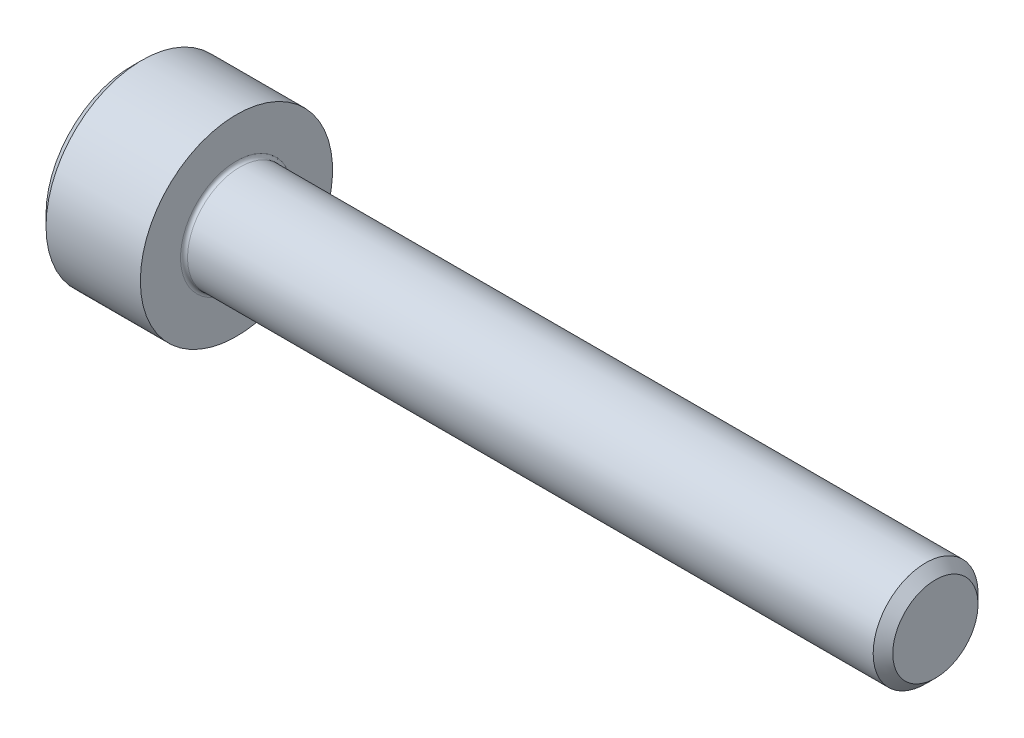
ISO-10303-21;
HEADER;
FILE_DESCRIPTION(('STEP AP214'),'2;1');
FILE_NAME('part.step','',(''),(''),'','','');
FILE_SCHEMA(('AUTOMOTIVE_DESIGN { 1 0 10303 214 1 1 1 1 }'));
ENDSEC;
DATA;
#1=APPLICATION_CONTEXT('core data for automotive mechanical design processes');
#2=APPLICATION_PROTOCOL_DEFINITION('international standard','automotive_design',2000,#1);
#3=PRODUCT_CONTEXT('',#1,'mechanical');
#4=PRODUCT('Part','Part','',(#3));
#5=PRODUCT_RELATED_PRODUCT_CATEGORY('part','',(#4));
#6=PRODUCT_DEFINITION_FORMATION('','',#4);
#7=PRODUCT_DEFINITION_CONTEXT('part definition',#1,'design');
#8=PRODUCT_DEFINITION('design','',#6,#7);
#9=PRODUCT_DEFINITION_SHAPE('','',#8);
#10=(LENGTH_UNIT() NAMED_UNIT(*) SI_UNIT(.MILLI.,.METRE.));
#11=(NAMED_UNIT(*) PLANE_ANGLE_UNIT() SI_UNIT($,.RADIAN.));
#12=(NAMED_UNIT(*) SI_UNIT($,.STERADIAN.) SOLID_ANGLE_UNIT());
#13=UNCERTAINTY_MEASURE_WITH_UNIT(LENGTH_MEASURE(1.E-05),#10,'distance_accuracy_value','');
#14=(GEOMETRIC_REPRESENTATION_CONTEXT(3) GLOBAL_UNCERTAINTY_ASSIGNED_CONTEXT((#13)) GLOBAL_UNIT_ASSIGNED_CONTEXT((#10,
#11,#12)) REPRESENTATION_CONTEXT('',''));
#15=CARTESIAN_POINT('',(0.,0.,0.));
#16=DIRECTION('',(0.,0.,1.));
#17=DIRECTION('',(1.,0.,0.));
#18=AXIS2_PLACEMENT_3D('',#15,#16,#17);
#19=CARTESIAN_POINT('',(0.,0.,0.));
#20=DIRECTION('',(-1.,0.,0.));
#21=DIRECTION('',(0.,0.,1.));
#22=AXIS2_PLACEMENT_3D('',#19,#20,#21);
#23=PLANE('',#22);
#24=DIRECTION('',(0.,-0.499999999999999,0.86602540378444));
#25=VECTOR('',#24,1.);
#26=CARTESIAN_POINT('',(0.,1.47801668912544,0.));
#27=LINE('',#26,#25);
#28=CARTESIAN_POINT('',(0.,1.47801668912544,0.));
#29=VERTEX_POINT('',#28);
#30=CARTESIAN_POINT('',(0.,0.73900834456272,1.28));
#31=VERTEX_POINT('',#30);
#32=EDGE_CURVE('E260',#29,#31,#27,.T.);
#33=ORIENTED_EDGE('',*,*,#32,.T.);
#34=DIRECTION('',(0.,1.,0.));
#35=VECTOR('',#34,1.);
#36=CARTESIAN_POINT('',(0.,-0.739008344562722,1.28));
#37=LINE('',#36,#35);
#38=CARTESIAN_POINT('',(0.,-0.739008344562722,1.28));
#39=VERTEX_POINT('',#38);
#40=EDGE_CURVE('E131',#39,#31,#37,.T.);
#41=ORIENTED_EDGE('',*,*,#40,.F.);
#42=DIRECTION('',(0.,-0.500000000000001,-0.866025403784438));
#43=VECTOR('',#42,1.);
#44=CARTESIAN_POINT('',(0.,-0.739008344562722,1.28));
#45=LINE('',#44,#43);
#46=CARTESIAN_POINT('',(0.,-1.47801668912545,0.));
#47=VERTEX_POINT('',#46);
#48=EDGE_CURVE('E263',#39,#47,#45,.T.);
#49=ORIENTED_EDGE('',*,*,#48,.T.);
#50=DIRECTION('',(0.,0.499999999999998,-0.86602540378444));
#51=VECTOR('',#50,1.);
#52=CARTESIAN_POINT('',(0.,-1.47801668912545,0.));
#53=LINE('',#52,#51);
#54=CARTESIAN_POINT('',(0.,-0.739008344562727,-1.28));
#55=VERTEX_POINT('',#54);
#56=EDGE_CURVE('E266',#47,#55,#53,.T.);
#57=ORIENTED_EDGE('',*,*,#56,.T.);
#58=DIRECTION('',(0.,-1.,0.));
#59=VECTOR('',#58,1.);
#60=CARTESIAN_POINT('',(0.,0.739008344562716,-1.28));
#61=LINE('',#60,#59);
#62=CARTESIAN_POINT('',(0.,0.739008344562716,-1.28));
#63=VERTEX_POINT('',#62);
#64=EDGE_CURVE('E269',#63,#55,#61,.T.);
#65=ORIENTED_EDGE('',*,*,#64,.F.);
#66=DIRECTION('',(0.,-0.500000000000001,-0.866025403784438));
#67=VECTOR('',#66,1.);
#68=CARTESIAN_POINT('',(0.,1.47801668912544,0.));
#69=LINE('',#68,#67);
#70=EDGE_CURVE('E126',#29,#63,#69,.T.);
#71=ORIENTED_EDGE('',*,*,#70,.F.);
#72=EDGE_LOOP('',(#33,#41,#49,#57,#65,#71));
#73=FACE_BOUND('',#72,.T.);
#74=CARTESIAN_POINT('',(0.,0.,0.));
#75=DIRECTION('',(-1.,0.,0.));
#76=DIRECTION('',(0.,0.,1.));
#77=AXIS2_PLACEMENT_3D('',#74,#75,#76);
#78=CIRCLE('',#77,2.45);
#79=CARTESIAN_POINT('',(0.,0.,2.45));
#80=VERTEX_POINT('',#79);
#81=EDGE_CURVE('E155',#80,#80,#78,.T.);
#82=ORIENTED_EDGE('',*,*,#81,.T.);
#83=EDGE_LOOP('',(#82));
#84=FACE_BOUND('',#83,.T.);
#85=ADVANCED_FACE('F35',(#73,#84),#23,.T.);
#86=CARTESIAN_POINT('',(0.,0.,0.));
#87=DIRECTION('',(1.,0.,0.));
#88=DIRECTION('',(0.,0.,-1.));
#89=AXIS2_PLACEMENT_3D('',#86,#87,#88);
#90=CONICAL_SURFACE('',#89,2.45,0.785398163397441);
#91=CARTESIAN_POINT('',(0.300000000000002,0.,0.));
#92=DIRECTION('',(-1.,0.,0.));
#93=DIRECTION('',(0.,0.,1.));
#94=AXIS2_PLACEMENT_3D('',#91,#92,#93);
#95=CIRCLE('',#94,2.75);
#96=CARTESIAN_POINT('',(0.300000000000002,0.,2.75));
#97=VERTEX_POINT('',#96);
#98=EDGE_CURVE('E152',#97,#97,#95,.T.);
#99=ORIENTED_EDGE('',*,*,#98,.T.);
#100=EDGE_LOOP('',(#99));
#101=FACE_BOUND('',#100,.T.);
#102=ORIENTED_EDGE('',*,*,#81,.F.);
#103=EDGE_LOOP('',(#102));
#104=FACE_BOUND('',#103,.T.);
#105=ADVANCED_FACE('F176',(#101,#104),#90,.T.);
#106=CARTESIAN_POINT('',(-31.75,0.,0.));
#107=DIRECTION('',(-1.,0.,0.));
#108=DIRECTION('',(0.,0.,1.));
#109=AXIS2_PLACEMENT_3D('',#106,#107,#108);
#110=CYLINDRICAL_SURFACE('',#109,2.75);
#111=CARTESIAN_POINT('',(3.,0.,0.));
#112=DIRECTION('',(-1.,0.,0.));
#113=DIRECTION('',(0.,0.,1.));
#114=AXIS2_PLACEMENT_3D('',#111,#112,#113);
#115=CIRCLE('',#114,2.75);
#116=CARTESIAN_POINT('',(3.,0.,2.75));
#117=VERTEX_POINT('',#116);
#118=EDGE_CURVE('E149',#117,#117,#115,.T.);
#119=ORIENTED_EDGE('',*,*,#118,.T.);
#120=EDGE_LOOP('',(#119));
#121=FACE_BOUND('',#120,.T.);
#122=ORIENTED_EDGE('',*,*,#98,.F.);
#123=EDGE_LOOP('',(#122));
#124=FACE_BOUND('',#123,.T.);
#125=ADVANCED_FACE('F181',(#121,#124),#110,.T.);
#126=CARTESIAN_POINT('',(3.,2.75,0.));
#127=DIRECTION('',(1.,0.,0.));
#128=DIRECTION('',(0.,0.,-1.));
#129=AXIS2_PLACEMENT_3D('',#126,#127,#128);
#130=PLANE('',#129);
#131=CARTESIAN_POINT('',(3.,0.,0.));
#132=DIRECTION('',(1.,0.,0.));
#133=DIRECTION('',(0.,0.,-1.));
#134=AXIS2_PLACEMENT_3D('',#131,#132,#133);
#135=CIRCLE('',#134,1.59999999999998);
#136=CARTESIAN_POINT('',(3.,0.,-1.59999999999998));
#137=VERTEX_POINT('',#136);
#138=EDGE_CURVE('E43',#137,#137,#135,.F.);
#139=ORIENTED_EDGE('',*,*,#138,.T.);
#140=EDGE_LOOP('',(#139));
#141=FACE_BOUND('',#140,.T.);
#142=ORIENTED_EDGE('',*,*,#118,.F.);
#143=EDGE_LOOP('',(#142));
#144=FACE_BOUND('',#143,.T.);
#145=ADVANCED_FACE('F160',(#141,#144),#130,.T.);
#146=CARTESIAN_POINT('',(-31.75,0.,0.));
#147=DIRECTION('',(-1.,0.,0.));
#148=DIRECTION('',(0.,0.,1.));
#149=AXIS2_PLACEMENT_3D('',#146,#147,#148);
#150=CYLINDRICAL_SURFACE('',#149,1.49999999999998);
#151=CARTESIAN_POINT('',(3.1,0.,0.));
#152=DIRECTION('',(1.,0.,0.));
#153=DIRECTION('',(0.,0.,-1.));
#154=AXIS2_PLACEMENT_3D('',#151,#152,#153);
#155=CIRCLE('',#154,1.49999999999998);
#156=CARTESIAN_POINT('',(3.1,0.,-1.49999999999998));
#157=VERTEX_POINT('',#156);
#158=EDGE_CURVE('E11',#157,#157,#155,.T.);
#159=ORIENTED_EDGE('',*,*,#158,.T.);
#160=EDGE_LOOP('',(#159));
#161=FACE_BOUND('',#160,.T.);
#162=CARTESIAN_POINT('',(22.7195,0.,0.));
#163=DIRECTION('',(-1.,0.,0.));
#164=DIRECTION('',(0.,0.,1.));
#165=AXIS2_PLACEMENT_3D('',#162,#163,#164);
#166=CIRCLE('',#165,1.49999999999996);
#167=CARTESIAN_POINT('',(22.7195,0.,1.49999999999996));
#168=VERTEX_POINT('',#167);
#169=EDGE_CURVE('E146',#168,#168,#166,.T.);
#170=ORIENTED_EDGE('',*,*,#169,.T.);
#171=EDGE_LOOP('',(#170));
#172=FACE_BOUND('',#171,.T.);
#173=ADVANCED_FACE('F191',(#161,#172),#150,.T.);
#174=CARTESIAN_POINT('',(23.,0.,0.));
#175=DIRECTION('',(-1.,0.,0.));
#176=DIRECTION('',(0.,0.,1.));
#177=AXIS2_PLACEMENT_3D('',#174,#175,#176);
#178=CONICAL_SURFACE('',#177,1.2195,0.78539816339732);
#179=ORIENTED_EDGE('',*,*,#169,.F.);
#180=EDGE_LOOP('',(#179));
#181=FACE_BOUND('',#180,.T.);
#182=CARTESIAN_POINT('',(23.,0.,0.));
#183=DIRECTION('',(-1.,0.,0.));
#184=DIRECTION('',(0.,0.,1.));
#185=AXIS2_PLACEMENT_3D('',#182,#183,#184);
#186=CIRCLE('',#185,1.2195);
#187=CARTESIAN_POINT('',(23.,0.,1.2195));
#188=VERTEX_POINT('',#187);
#189=EDGE_CURVE('E142',#188,#188,#186,.T.);
#190=ORIENTED_EDGE('',*,*,#189,.T.);
#191=EDGE_LOOP('',(#190));
#192=FACE_BOUND('',#191,.T.);
#193=ADVANCED_FACE('F171',(#181,#192),#178,.T.);
#194=CARTESIAN_POINT('',(23.,1.2195,0.));
#195=DIRECTION('',(1.,0.,0.));
#196=DIRECTION('',(0.,0.,-1.));
#197=AXIS2_PLACEMENT_3D('',#194,#195,#196);
#198=PLANE('',#197);
#199=ORIENTED_EDGE('',*,*,#189,.F.);
#200=EDGE_LOOP('',(#199));
#201=FACE_BOUND('',#200,.T.);
#202=ADVANCED_FACE('F164',(#201),#198,.T.);
#203=CARTESIAN_POINT('',(3.1,0.,0.));
#204=DIRECTION('',(1.,0.,0.));
#205=DIRECTION('',(0.,0.,-1.));
#206=AXIS2_PLACEMENT_3D('',#203,#204,#205);
#207=TOROIDAL_SURFACE('',#206,1.59999999999998,0.1);
#208=ORIENTED_EDGE('',*,*,#158,.F.);
#209=EDGE_LOOP('',(#208));
#210=FACE_BOUND('',#209,.T.);
#211=ORIENTED_EDGE('',*,*,#138,.F.);
#212=EDGE_LOOP('',(#211));
#213=FACE_BOUND('',#212,.T.);
#214=ADVANCED_FACE('F37',(#210,#213),#207,.F.);
#215=CARTESIAN_POINT('',(1.3,1.47801668912544,0.));
#216=DIRECTION('',(0.,-0.86602540378444,-0.499999999999999));
#217=DIRECTION('',(0.,0.499999999999999,-0.86602540378444));
#218=AXIS2_PLACEMENT_3D('',#215,#216,#217);
#219=PLANE('',#218);
#220=ORIENTED_EDGE('',*,*,#32,.F.);
#221=DIRECTION('',(-1.,0.,0.));
#222=VECTOR('',#221,1.);
#223=CARTESIAN_POINT('',(1.3,1.47801668912544,0.));
#224=LINE('',#223,#222);
#225=CARTESIAN_POINT('',(1.3,1.47801668912544,0.));
#226=VERTEX_POINT('',#225);
#227=EDGE_CURVE('E250',#226,#29,#224,.T.);
#228=ORIENTED_EDGE('',*,*,#227,.F.);
#229=DIRECTION('',(0.,-0.499999999999999,0.86602540378444));
#230=VECTOR('',#229,1.);
#231=CARTESIAN_POINT('',(1.3,1.47801668912544,0.));
#232=LINE('',#231,#230);
#233=CARTESIAN_POINT('',(1.3,1.10851251684408,0.639999999999996));
#234=VERTEX_POINT('',#233);
#235=EDGE_CURVE('E118',#226,#234,#232,.T.);
#236=ORIENTED_EDGE('',*,*,#235,.T.);
#237=CARTESIAN_POINT('',(1.3,0.73900834456272,1.28));
#238=VERTEX_POINT('',#237);
#239=EDGE_CURVE('E109',#234,#238,#232,.T.);
#240=ORIENTED_EDGE('',*,*,#239,.T.);
#241=DIRECTION('',(-1.,0.,0.));
#242=VECTOR('',#241,1.);
#243=CARTESIAN_POINT('',(1.3,0.73900834456272,1.28));
#244=LINE('',#243,#242);
#245=EDGE_CURVE('E123',#238,#31,#244,.T.);
#246=ORIENTED_EDGE('',*,*,#245,.T.);
#247=EDGE_LOOP('',(#220,#228,#236,#240,#246));
#248=FACE_BOUND('',#247,.T.);
#249=ADVANCED_FACE('F122',(#248),#219,.T.);
#250=CARTESIAN_POINT('',(1.3,-0.739008344562722,1.28));
#251=DIRECTION('',(0.,0.,1.));
#252=DIRECTION('',(0.,-1.,0.));
#253=AXIS2_PLACEMENT_3D('',#250,#251,#252);
#254=PLANE('',#253);
#255=ORIENTED_EDGE('',*,*,#40,.T.);
#256=ORIENTED_EDGE('',*,*,#245,.F.);
#257=DIRECTION('',(0.,1.,0.));
#258=VECTOR('',#257,1.);
#259=CARTESIAN_POINT('',(1.3,-0.739008344562722,1.28));
#260=LINE('',#259,#258);
#261=CARTESIAN_POINT('',(1.3,0.,1.28));
#262=VERTEX_POINT('',#261);
#263=EDGE_CURVE('E106',#262,#238,#260,.T.);
#264=ORIENTED_EDGE('',*,*,#263,.F.);
#265=CARTESIAN_POINT('',(1.3,-0.739008344562722,1.28));
#266=VERTEX_POINT('',#265);
#267=EDGE_CURVE('E117',#266,#262,#260,.T.);
#268=ORIENTED_EDGE('',*,*,#267,.F.);
#269=DIRECTION('',(-1.,0.,0.));
#270=VECTOR('',#269,1.);
#271=CARTESIAN_POINT('',(1.3,-0.739008344562722,1.28));
#272=LINE('',#271,#270);
#273=EDGE_CURVE('E133',#266,#39,#272,.T.);
#274=ORIENTED_EDGE('',*,*,#273,.T.);
#275=EDGE_LOOP('',(#255,#256,#264,#268,#274));
#276=FACE_BOUND('',#275,.T.);
#277=ADVANCED_FACE('F128',(#276),#254,.F.);
#278=CARTESIAN_POINT('',(1.3,-0.739008344562722,1.28));
#279=DIRECTION('',(0.,0.866025403784438,-0.500000000000001));
#280=DIRECTION('',(0.,0.500000000000001,0.866025403784438));
#281=AXIS2_PLACEMENT_3D('',#278,#279,#280);
#282=PLANE('',#281);
#283=ORIENTED_EDGE('',*,*,#48,.F.);
#284=ORIENTED_EDGE('',*,*,#273,.F.);
#285=DIRECTION('',(0.,-0.500000000000001,-0.866025403784438));
#286=VECTOR('',#285,1.);
#287=CARTESIAN_POINT('',(1.3,-0.739008344562722,1.28));
#288=LINE('',#287,#286);
#289=CARTESIAN_POINT('',(1.3,-1.10851251684408,0.640000000000002));
#290=VERTEX_POINT('',#289);
#291=EDGE_CURVE('E289',#266,#290,#288,.T.);
#292=ORIENTED_EDGE('',*,*,#291,.T.);
#293=CARTESIAN_POINT('',(1.3,-1.47801668912545,0.));
#294=VERTEX_POINT('',#293);
#295=EDGE_CURVE('E278',#290,#294,#288,.T.);
#296=ORIENTED_EDGE('',*,*,#295,.T.);
#297=DIRECTION('',(-1.,0.,0.));
#298=VECTOR('',#297,1.);
#299=CARTESIAN_POINT('',(1.3,-1.47801668912545,0.));
#300=LINE('',#299,#298);
#301=EDGE_CURVE('E138',#294,#47,#300,.T.);
#302=ORIENTED_EDGE('',*,*,#301,.T.);
#303=EDGE_LOOP('',(#283,#284,#292,#296,#302));
#304=FACE_BOUND('',#303,.T.);
#305=ADVANCED_FACE('F204',(#304),#282,.T.);
#306=CARTESIAN_POINT('',(1.3,-1.47801668912545,0.));
#307=DIRECTION('',(0.,0.86602540378444,0.499999999999998));
#308=DIRECTION('',(0.,-0.499999999999998,0.86602540378444));
#309=AXIS2_PLACEMENT_3D('',#306,#307,#308);
#310=PLANE('',#309);
#311=ORIENTED_EDGE('',*,*,#56,.F.);
#312=ORIENTED_EDGE('',*,*,#301,.F.);
#313=DIRECTION('',(0.,0.499999999999998,-0.86602540378444));
#314=VECTOR('',#313,1.);
#315=CARTESIAN_POINT('',(1.3,-1.47801668912545,0.));
#316=LINE('',#315,#314);
#317=CARTESIAN_POINT('',(1.3,-1.10851251684409,-0.64));
#318=VERTEX_POINT('',#317);
#319=EDGE_CURVE('E256',#294,#318,#316,.T.);
#320=ORIENTED_EDGE('',*,*,#319,.T.);
#321=CARTESIAN_POINT('',(1.3,-0.739008344562727,-1.28));
#322=VERTEX_POINT('',#321);
#323=EDGE_CURVE('E288',#318,#322,#316,.T.);
#324=ORIENTED_EDGE('',*,*,#323,.T.);
#325=DIRECTION('',(-1.,0.,0.));
#326=VECTOR('',#325,1.);
#327=CARTESIAN_POINT('',(1.3,-0.739008344562727,-1.28));
#328=LINE('',#327,#326);
#329=EDGE_CURVE('E249',#322,#55,#328,.T.);
#330=ORIENTED_EDGE('',*,*,#329,.T.);
#331=EDGE_LOOP('',(#311,#312,#320,#324,#330));
#332=FACE_BOUND('',#331,.T.);
#333=ADVANCED_FACE('F207',(#332),#310,.T.);
#334=CARTESIAN_POINT('',(1.3,0.739008344562716,-1.28));
#335=DIRECTION('',(0.,0.,-1.));
#336=DIRECTION('',(0.,1.,0.));
#337=AXIS2_PLACEMENT_3D('',#334,#335,#336);
#338=PLANE('',#337);
#339=ORIENTED_EDGE('',*,*,#64,.T.);
#340=ORIENTED_EDGE('',*,*,#329,.F.);
#341=DIRECTION('',(0.,-1.,0.));
#342=VECTOR('',#341,1.);
#343=CARTESIAN_POINT('',(1.3,0.739008344562716,-1.28));
#344=LINE('',#343,#342);
#345=CARTESIAN_POINT('',(1.3,0.,-1.28));
#346=VERTEX_POINT('',#345);
#347=EDGE_CURVE('E253',#346,#322,#344,.T.);
#348=ORIENTED_EDGE('',*,*,#347,.F.);
#349=CARTESIAN_POINT('',(1.3,0.739008344562716,-1.28));
#350=VERTEX_POINT('',#349);
#351=EDGE_CURVE('E50',#350,#346,#344,.T.);
#352=ORIENTED_EDGE('',*,*,#351,.F.);
#353=DIRECTION('',(-1.,0.,0.));
#354=VECTOR('',#353,1.);
#355=CARTESIAN_POINT('',(1.3,0.739008344562716,-1.28));
#356=LINE('',#355,#354);
#357=EDGE_CURVE('E246',#350,#63,#356,.T.);
#358=ORIENTED_EDGE('',*,*,#357,.T.);
#359=EDGE_LOOP('',(#339,#340,#348,#352,#358));
#360=FACE_BOUND('',#359,.T.);
#361=ADVANCED_FACE('F211',(#360),#338,.F.);
#362=CARTESIAN_POINT('',(1.3,1.47801668912544,0.));
#363=DIRECTION('',(0.,0.866025403784438,-0.500000000000001));
#364=DIRECTION('',(0.,0.500000000000001,0.866025403784438));
#365=AXIS2_PLACEMENT_3D('',#362,#363,#364);
#366=PLANE('',#365);
#367=ORIENTED_EDGE('',*,*,#70,.T.);
#368=ORIENTED_EDGE('',*,*,#357,.F.);
#369=DIRECTION('',(0.,-0.500000000000001,-0.866025403784438));
#370=VECTOR('',#369,1.);
#371=CARTESIAN_POINT('',(1.3,1.47801668912544,0.));
#372=LINE('',#371,#370);
#373=CARTESIAN_POINT('',(1.3,1.10851251684408,-0.64));
#374=VERTEX_POINT('',#373);
#375=EDGE_CURVE('E236',#374,#350,#372,.T.);
#376=ORIENTED_EDGE('',*,*,#375,.F.);
#377=EDGE_CURVE('E242',#226,#374,#372,.T.);
#378=ORIENTED_EDGE('',*,*,#377,.F.);
#379=ORIENTED_EDGE('',*,*,#227,.T.);
#380=EDGE_LOOP('',(#367,#368,#376,#378,#379));
#381=FACE_BOUND('',#380,.T.);
#382=ADVANCED_FACE('F215',(#381),#366,.F.);
#383=CARTESIAN_POINT('',(1.3,2.21702503368816,-1.28));
#384=DIRECTION('',(1.,0.,0.));
#385=DIRECTION('',(0.,0.,-1.));
#386=AXIS2_PLACEMENT_3D('',#383,#384,#385);
#387=PLANE('',#386);
#388=ORIENTED_EDGE('',*,*,#347,.T.);
#389=ORIENTED_EDGE('',*,*,#323,.F.);
#390=CARTESIAN_POINT('',(1.3,0.,0.));
#391=DIRECTION('',(-1.,0.,0.));
#392=DIRECTION('',(0.,0.,1.));
#393=AXIS2_PLACEMENT_3D('',#390,#391,#392);
#394=CIRCLE('',#393,1.28);
#395=EDGE_CURVE('E284',#346,#318,#394,.T.);
#396=ORIENTED_EDGE('',*,*,#395,.F.);
#397=EDGE_LOOP('',(#388,#389,#396));
#398=FACE_BOUND('',#397,.T.);
#399=ADVANCED_FACE('F219',(#398),#387,.F.);
#400=ORIENTED_EDGE('',*,*,#319,.F.);
#401=ORIENTED_EDGE('',*,*,#295,.F.);
#402=EDGE_CURVE('E136',#318,#290,#394,.T.);
#403=ORIENTED_EDGE('',*,*,#402,.F.);
#404=EDGE_LOOP('',(#400,#401,#403));
#405=FACE_BOUND('',#404,.T.);
#406=ADVANCED_FACE('F222',(#405),#387,.F.);
#407=ORIENTED_EDGE('',*,*,#291,.F.);
#408=ORIENTED_EDGE('',*,*,#267,.T.);
#409=EDGE_CURVE('E132',#290,#262,#394,.T.);
#410=ORIENTED_EDGE('',*,*,#409,.F.);
#411=EDGE_LOOP('',(#407,#408,#410));
#412=FACE_BOUND('',#411,.T.);
#413=ADVANCED_FACE('F227',(#412),#387,.F.);
#414=ORIENTED_EDGE('',*,*,#263,.T.);
#415=ORIENTED_EDGE('',*,*,#239,.F.);
#416=EDGE_CURVE('E112',#262,#234,#394,.T.);
#417=ORIENTED_EDGE('',*,*,#416,.F.);
#418=EDGE_LOOP('',(#414,#415,#417));
#419=FACE_BOUND('',#418,.T.);
#420=ADVANCED_FACE('F108',(#419),#387,.F.);
#421=ORIENTED_EDGE('',*,*,#235,.F.);
#422=ORIENTED_EDGE('',*,*,#377,.T.);
#423=EDGE_CURVE('E143',#234,#374,#394,.T.);
#424=ORIENTED_EDGE('',*,*,#423,.F.);
#425=EDGE_LOOP('',(#421,#422,#424));
#426=FACE_BOUND('',#425,.T.);
#427=ADVANCED_FACE('F230',(#426),#387,.F.);
#428=ORIENTED_EDGE('',*,*,#375,.T.);
#429=ORIENTED_EDGE('',*,*,#351,.T.);
#430=EDGE_CURVE('E239',#374,#346,#394,.T.);
#431=ORIENTED_EDGE('',*,*,#430,.F.);
#432=EDGE_LOOP('',(#428,#429,#431));
#433=FACE_BOUND('',#432,.T.);
#434=ADVANCED_FACE('F200',(#433),#387,.F.);
#435=CARTESIAN_POINT('',(1.3,0.,0.));
#436=DIRECTION('',(-1.,0.,0.));
#437=DIRECTION('',(0.,0.,1.));
#438=AXIS2_PLACEMENT_3D('',#435,#436,#437);
#439=CONICAL_SURFACE('',#438,1.28,1.0471975511966);
#440=CARTESIAN_POINT('',(2.03900834456273,0.,0.));
#441=VERTEX_POINT('',#440);
#442=VERTEX_LOOP('',#441);
#443=FACE_BOUND('',#442,.T.);
#444=ORIENTED_EDGE('',*,*,#416,.T.);
#445=ORIENTED_EDGE('',*,*,#423,.T.);
#446=ORIENTED_EDGE('',*,*,#430,.T.);
#447=ORIENTED_EDGE('',*,*,#395,.T.);
#448=ORIENTED_EDGE('',*,*,#402,.T.);
#449=ORIENTED_EDGE('',*,*,#409,.T.);
#450=EDGE_LOOP('',(#444,#445,#446,#447,#448,#449));
#451=FACE_BOUND('',#450,.T.);
#452=ADVANCED_FACE('F198',(#443,#451),#439,.F.);
#453=CLOSED_SHELL('',(#85,#105,#125,#145,#173,#193,#202,#214,#249,#277,#305,#333,#361,#382,#399,
#406,#413,#420,#427,#434,#452));
#454=MANIFOLD_SOLID_BREP('B2',#453);
#455=ADVANCED_BREP_SHAPE_REPRESENTATION('',(#18,#454),#14);
#456=SHAPE_DEFINITION_REPRESENTATION(#9,#455);
ENDSEC;
END-ISO-10303-21;
